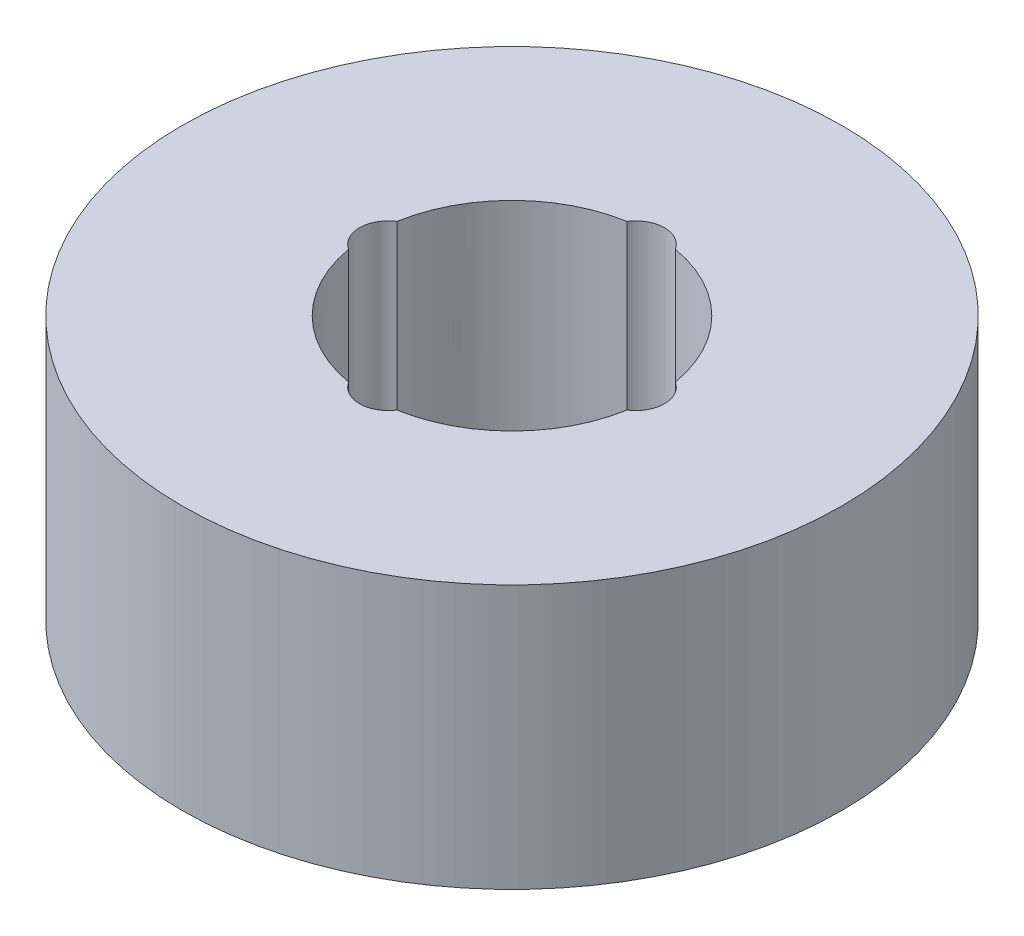
ISO-10303-21;
HEADER;
FILE_DESCRIPTION(('STEP AP214'),'2;1');
FILE_NAME('part.step','',(''),(''),'','','');
FILE_SCHEMA(('AUTOMOTIVE_DESIGN { 1 0 10303 214 1 1 1 1 }'));
ENDSEC;
DATA;
#1=APPLICATION_CONTEXT('core data for automotive mechanical design processes');
#2=APPLICATION_PROTOCOL_DEFINITION('international standard','automotive_design',2000,#1);
#3=PRODUCT_CONTEXT('',#1,'mechanical');
#4=PRODUCT('Part','Part','',(#3));
#5=PRODUCT_RELATED_PRODUCT_CATEGORY('part','',(#4));
#6=PRODUCT_DEFINITION_FORMATION('','',#4);
#7=PRODUCT_DEFINITION_CONTEXT('part definition',#1,'design');
#8=PRODUCT_DEFINITION('design','',#6,#7);
#9=PRODUCT_DEFINITION_SHAPE('','',#8);
#10=(LENGTH_UNIT() NAMED_UNIT(*) SI_UNIT(.MILLI.,.METRE.));
#11=(NAMED_UNIT(*) PLANE_ANGLE_UNIT() SI_UNIT($,.RADIAN.));
#12=(NAMED_UNIT(*) SI_UNIT($,.STERADIAN.) SOLID_ANGLE_UNIT());
#13=UNCERTAINTY_MEASURE_WITH_UNIT(LENGTH_MEASURE(1.E-05),#10,'distance_accuracy_value','');
#14=(GEOMETRIC_REPRESENTATION_CONTEXT(3) GLOBAL_UNCERTAINTY_ASSIGNED_CONTEXT((#13)) GLOBAL_UNIT_ASSIGNED_CONTEXT((#10,
#11,#12)) REPRESENTATION_CONTEXT('',''));
#15=CARTESIAN_POINT('',(0.,0.,0.));
#16=DIRECTION('',(0.,0.,1.));
#17=DIRECTION('',(1.,0.,0.));
#18=AXIS2_PLACEMENT_3D('',#15,#16,#17);
#19=CARTESIAN_POINT('',(0.,14.,0.));
#20=DIRECTION('',(0.,-1.,0.));
#21=DIRECTION('',(0.,0.,-1.));
#22=AXIS2_PLACEMENT_3D('',#19,#20,#21);
#23=CYLINDRICAL_SURFACE('',#22,17.5);
#24=CARTESIAN_POINT('',(0.,14.,0.));
#25=DIRECTION('',(0.,1.,0.));
#26=DIRECTION('',(0.,0.,1.));
#27=AXIS2_PLACEMENT_3D('',#24,#25,#26);
#28=CIRCLE('',#27,17.5);
#29=CARTESIAN_POINT('',(0.,14.,17.5));
#30=VERTEX_POINT('',#29);
#31=EDGE_CURVE('E148',#30,#30,#28,.T.);
#32=ORIENTED_EDGE('',*,*,#31,.F.);
#33=EDGE_LOOP('',(#32));
#34=FACE_BOUND('',#33,.T.);
#35=CARTESIAN_POINT('',(0.,0.,0.));
#36=DIRECTION('',(0.,1.,0.));
#37=DIRECTION('',(0.,0.,1.));
#38=AXIS2_PLACEMENT_3D('',#35,#36,#37);
#39=CIRCLE('',#38,17.5);
#40=CARTESIAN_POINT('',(0.,0.,17.5));
#41=VERTEX_POINT('',#40);
#42=EDGE_CURVE('E139',#41,#41,#39,.T.);
#43=ORIENTED_EDGE('',*,*,#42,.T.);
#44=EDGE_LOOP('',(#43));
#45=FACE_BOUND('',#44,.T.);
#46=ADVANCED_FACE('F39',(#34,#45),#23,.T.);
#47=CARTESIAN_POINT('',(0.,14.,0.));
#48=DIRECTION('',(0.,1.,0.));
#49=DIRECTION('',(0.,0.,1.));
#50=AXIS2_PLACEMENT_3D('',#47,#48,#49);
#51=PLANE('',#50);
#52=CARTESIAN_POINT('',(0.,14.,6.56736885858729));
#53=DIRECTION('',(0.,1.,0.));
#54=DIRECTION('',(1.,0.,0.));
#55=AXIS2_PLACEMENT_3D('',#52,#53,#54);
#56=CIRCLE('',#55,1.52423775104503);
#57=CARTESIAN_POINT('',(-1.28361419085378,14.,7.38933925388724));
#58=VERTEX_POINT('',#57);
#59=CARTESIAN_POINT('',(1.28361419085383,14.,7.38933925388723));
#60=VERTEX_POINT('',#59);
#61=EDGE_CURVE('E175',#58,#60,#56,.T.);
#62=ORIENTED_EDGE('',*,*,#61,.F.);
#63=CARTESIAN_POINT('',(0.,14.,0.));
#64=DIRECTION('',(0.,1.,0.));
#65=DIRECTION('',(0.,0.,1.));
#66=AXIS2_PLACEMENT_3D('',#63,#64,#65);
#67=CIRCLE('',#66,7.5);
#68=CARTESIAN_POINT('',(-7.38933925388723,14.,1.2836141908538));
#69=VERTEX_POINT('',#68);
#70=EDGE_CURVE('E134',#69,#58,#67,.T.);
#71=ORIENTED_EDGE('',*,*,#70,.F.);
#72=CARTESIAN_POINT('',(-6.56736885858729,14.,0.));
#73=DIRECTION('',(0.,1.,0.));
#74=DIRECTION('',(0.,0.,1.));
#75=AXIS2_PLACEMENT_3D('',#72,#73,#74);
#76=CIRCLE('',#75,1.52423775104503);
#77=CARTESIAN_POINT('',(-7.38933925388723,14.,-1.2836141908538));
#78=VERTEX_POINT('',#77);
#79=EDGE_CURVE('E143',#78,#69,#76,.T.);
#80=ORIENTED_EDGE('',*,*,#79,.F.);
#81=CARTESIAN_POINT('',(-1.28361419085388,14.,-7.38933925388722));
#82=VERTEX_POINT('',#81);
#83=EDGE_CURVE('E123',#82,#78,#67,.T.);
#84=ORIENTED_EDGE('',*,*,#83,.F.);
#85=CARTESIAN_POINT('',(0.,14.,-6.56736885858729));
#86=DIRECTION('',(0.,1.,0.));
#87=DIRECTION('',(-1.,0.,0.));
#88=AXIS2_PLACEMENT_3D('',#85,#86,#87);
#89=CIRCLE('',#88,1.52423775104503);
#90=CARTESIAN_POINT('',(1.28361419085373,14.,-7.38933925388725));
#91=VERTEX_POINT('',#90);
#92=EDGE_CURVE('E106',#91,#82,#89,.T.);
#93=ORIENTED_EDGE('',*,*,#92,.F.);
#94=CARTESIAN_POINT('',(7.38933925388723,14.,-1.2836141908538));
#95=VERTEX_POINT('',#94);
#96=EDGE_CURVE('E125',#95,#91,#67,.T.);
#97=ORIENTED_EDGE('',*,*,#96,.F.);
#98=CARTESIAN_POINT('',(6.56736885858729,14.,0.));
#99=DIRECTION('',(0.,1.,0.));
#100=DIRECTION('',(0.,0.,-1.));
#101=AXIS2_PLACEMENT_3D('',#98,#99,#100);
#102=CIRCLE('',#101,1.52423775104503);
#103=CARTESIAN_POINT('',(7.38933925388723,14.,1.2836141908538));
#104=VERTEX_POINT('',#103);
#105=EDGE_CURVE('E286',#104,#95,#102,.T.);
#106=ORIENTED_EDGE('',*,*,#105,.F.);
#107=EDGE_CURVE('E135',#60,#104,#67,.T.);
#108=ORIENTED_EDGE('',*,*,#107,.F.);
#109=EDGE_LOOP('',(#62,#71,#80,#84,#93,#97,#106,#108));
#110=FACE_BOUND('',#109,.T.);
#111=ORIENTED_EDGE('',*,*,#31,.T.);
#112=EDGE_LOOP('',(#111));
#113=FACE_BOUND('',#112,.T.);
#114=ADVANCED_FACE('F118',(#110,#113),#51,.T.);
#115=CARTESIAN_POINT('',(0.,0.,0.));
#116=DIRECTION('',(0.,1.,0.));
#117=DIRECTION('',(0.,0.,1.));
#118=AXIS2_PLACEMENT_3D('',#115,#116,#117);
#119=PLANE('',#118);
#120=CARTESIAN_POINT('',(0.,0.,0.));
#121=DIRECTION('',(0.,1.,0.));
#122=DIRECTION('',(0.,0.,1.));
#123=AXIS2_PLACEMENT_3D('',#120,#121,#122);
#124=CIRCLE('',#123,7.5);
#125=CARTESIAN_POINT('',(0.,0.,7.5));
#126=VERTEX_POINT('',#125);
#127=EDGE_CURVE('E136',#126,#126,#124,.T.);
#128=ORIENTED_EDGE('',*,*,#127,.T.);
#129=EDGE_LOOP('',(#128));
#130=FACE_BOUND('',#129,.T.);
#131=ORIENTED_EDGE('',*,*,#42,.F.);
#132=EDGE_LOOP('',(#131));
#133=FACE_BOUND('',#132,.T.);
#134=ADVANCED_FACE('F187',(#130,#133),#119,.F.);
#135=CARTESIAN_POINT('',(0.,14.,0.));
#136=DIRECTION('',(0.,-1.,0.));
#137=DIRECTION('',(0.,0.,-1.));
#138=AXIS2_PLACEMENT_3D('',#135,#136,#137);
#139=CYLINDRICAL_SURFACE('',#138,7.5);
#140=DIRECTION('',(0.,1.,0.));
#141=VECTOR('',#140,1.);
#142=CARTESIAN_POINT('',(-1.28361419085378,9.5207751766926,7.38933925388724));
#143=LINE('',#142,#141);
#144=CARTESIAN_POINT('',(-1.28361419085378,5.04155035338519,7.38933925388724));
#145=VERTEX_POINT('',#144);
#146=EDGE_CURVE('E11',#145,#58,#143,.T.);
#147=ORIENTED_EDGE('',*,*,#146,.F.);
#148=CARTESIAN_POINT('',(0.,5.04155035338519,0.));
#149=DIRECTION('',(0.,1.,0.));
#150=DIRECTION('',(0.,0.,1.));
#151=AXIS2_PLACEMENT_3D('',#148,#149,#150);
#152=CIRCLE('',#151,7.5);
#153=CARTESIAN_POINT('',(1.28361419085383,5.04155035338519,7.38933925388723));
#154=VERTEX_POINT('',#153);
#155=EDGE_CURVE('E170',#145,#154,#152,.T.);
#156=ORIENTED_EDGE('',*,*,#155,.T.);
#157=DIRECTION('',(0.,1.,0.));
#158=VECTOR('',#157,1.);
#159=CARTESIAN_POINT('',(1.28361419085383,9.5207751766926,7.38933925388723));
#160=LINE('',#159,#158);
#161=EDGE_CURVE('E46',#60,#154,#160,.F.);
#162=ORIENTED_EDGE('',*,*,#161,.F.);
#163=ORIENTED_EDGE('',*,*,#107,.T.);
#164=DIRECTION('',(0.,1.,0.));
#165=VECTOR('',#164,1.);
#166=CARTESIAN_POINT('',(7.38933925388723,9.5207751766926,1.2836141908538));
#167=LINE('',#166,#165);
#168=CARTESIAN_POINT('',(7.38933925388723,5.04155035338519,1.2836141908538));
#169=VERTEX_POINT('',#168);
#170=EDGE_CURVE('E164',#169,#104,#167,.T.);
#171=ORIENTED_EDGE('',*,*,#170,.F.);
#172=CARTESIAN_POINT('',(0.,5.04155035338519,0.));
#173=DIRECTION('',(0.,1.,0.));
#174=DIRECTION('',(0.,0.,1.));
#175=AXIS2_PLACEMENT_3D('',#172,#173,#174);
#176=CIRCLE('',#175,7.5);
#177=CARTESIAN_POINT('',(7.38933925388723,5.04155035338519,-1.2836141908538));
#178=VERTEX_POINT('',#177);
#179=EDGE_CURVE('E115',#169,#178,#176,.T.);
#180=ORIENTED_EDGE('',*,*,#179,.T.);
#181=DIRECTION('',(0.,1.,0.));
#182=VECTOR('',#181,1.);
#183=CARTESIAN_POINT('',(7.38933925388723,9.5207751766926,-1.2836141908538));
#184=LINE('',#183,#182);
#185=EDGE_CURVE('E131',#95,#178,#184,.F.);
#186=ORIENTED_EDGE('',*,*,#185,.F.);
#187=ORIENTED_EDGE('',*,*,#96,.T.);
#188=DIRECTION('',(0.,1.,0.));
#189=VECTOR('',#188,1.);
#190=CARTESIAN_POINT('',(1.28361419085373,9.5207751766926,-7.38933925388725));
#191=LINE('',#190,#189);
#192=CARTESIAN_POINT('',(1.28361419085373,5.04155035338519,-7.38933925388725));
#193=VERTEX_POINT('',#192);
#194=EDGE_CURVE('E105',#193,#91,#191,.T.);
#195=ORIENTED_EDGE('',*,*,#194,.F.);
#196=CARTESIAN_POINT('',(0.,5.04155035338519,0.));
#197=DIRECTION('',(0.,1.,0.));
#198=DIRECTION('',(0.,0.,1.));
#199=AXIS2_PLACEMENT_3D('',#196,#197,#198);
#200=CIRCLE('',#199,7.5);
#201=CARTESIAN_POINT('',(-1.28361419085388,5.04155035338519,-7.38933925388722));
#202=VERTEX_POINT('',#201);
#203=EDGE_CURVE('E159',#193,#202,#200,.T.);
#204=ORIENTED_EDGE('',*,*,#203,.T.);
#205=DIRECTION('',(0.,1.,0.));
#206=VECTOR('',#205,1.);
#207=CARTESIAN_POINT('',(-1.28361419085388,9.5207751766926,-7.38933925388722));
#208=LINE('',#207,#206);
#209=EDGE_CURVE('E114',#82,#202,#208,.F.);
#210=ORIENTED_EDGE('',*,*,#209,.F.);
#211=ORIENTED_EDGE('',*,*,#83,.T.);
#212=DIRECTION('',(0.,1.,0.));
#213=VECTOR('',#212,1.);
#214=CARTESIAN_POINT('',(-7.38933925388723,9.5207751766926,-1.2836141908538));
#215=LINE('',#214,#213);
#216=CARTESIAN_POINT('',(-7.38933925388723,5.04155035338519,-1.2836141908538));
#217=VERTEX_POINT('',#216);
#218=EDGE_CURVE('E160',#217,#78,#215,.T.);
#219=ORIENTED_EDGE('',*,*,#218,.F.);
#220=CARTESIAN_POINT('',(0.,5.04155035338519,0.));
#221=DIRECTION('',(0.,1.,0.));
#222=DIRECTION('',(0.,0.,1.));
#223=AXIS2_PLACEMENT_3D('',#220,#221,#222);
#224=CIRCLE('',#223,7.5);
#225=CARTESIAN_POINT('',(-7.38933925388723,5.04155035338519,1.2836141908538));
#226=VERTEX_POINT('',#225);
#227=EDGE_CURVE('E149',#217,#226,#224,.T.);
#228=ORIENTED_EDGE('',*,*,#227,.T.);
#229=DIRECTION('',(0.,1.,0.));
#230=VECTOR('',#229,1.);
#231=CARTESIAN_POINT('',(-7.38933925388723,9.5207751766926,1.2836141908538));
#232=LINE('',#231,#230);
#233=EDGE_CURVE('E152',#69,#226,#232,.F.);
#234=ORIENTED_EDGE('',*,*,#233,.F.);
#235=ORIENTED_EDGE('',*,*,#70,.T.);
#236=EDGE_LOOP('',(#147,#156,#162,#163,#171,#180,#186,#187,#195,#204,#210,#211,#219,#228,#234,#235));
#237=FACE_BOUND('',#236,.T.);
#238=ORIENTED_EDGE('',*,*,#127,.F.);
#239=EDGE_LOOP('',(#238));
#240=FACE_BOUND('',#239,.T.);
#241=ADVANCED_FACE('F126',(#237,#240),#139,.F.);
#242=CARTESIAN_POINT('',(-6.56736885858729,5.04155035338519,0.));
#243=DIRECTION('',(0.,1.,0.));
#244=DIRECTION('',(0.,0.,1.));
#245=AXIS2_PLACEMENT_3D('',#242,#243,#244);
#246=CYLINDRICAL_SURFACE('',#245,1.52423775104503);
#247=ORIENTED_EDGE('',*,*,#218,.T.);
#248=ORIENTED_EDGE('',*,*,#79,.T.);
#249=ORIENTED_EDGE('',*,*,#233,.T.);
#250=CARTESIAN_POINT('',(-6.56736885858729,5.04155035338519,0.));
#251=DIRECTION('',(0.,1.,0.));
#252=DIRECTION('',(0.,0.,1.));
#253=AXIS2_PLACEMENT_3D('',#250,#251,#252);
#254=CIRCLE('',#253,1.52423775104503);
#255=EDGE_CURVE('E144',#217,#226,#254,.T.);
#256=ORIENTED_EDGE('',*,*,#255,.F.);
#257=EDGE_LOOP('',(#247,#248,#249,#256));
#258=FACE_BOUND('',#257,.T.);
#259=ADVANCED_FACE('F200',(#258),#246,.F.);
#260=CARTESIAN_POINT('',(-6.56736885858729,5.04155035338519,0.));
#261=DIRECTION('',(0.,1.,0.));
#262=DIRECTION('',(0.,0.,1.));
#263=AXIS2_PLACEMENT_3D('',#260,#261,#262);
#264=PLANE('',#263);
#265=ORIENTED_EDGE('',*,*,#255,.T.);
#266=ORIENTED_EDGE('',*,*,#227,.F.);
#267=EDGE_LOOP('',(#265,#266));
#268=FACE_BOUND('',#267,.T.);
#269=ADVANCED_FACE('F201',(#268),#264,.T.);
#270=CARTESIAN_POINT('',(0.,5.04155035338519,-6.56736885858729));
#271=DIRECTION('',(0.,1.,0.));
#272=DIRECTION('',(0.,0.,1.));
#273=AXIS2_PLACEMENT_3D('',#270,#271,#272);
#274=CYLINDRICAL_SURFACE('',#273,1.52423775104503);
#275=ORIENTED_EDGE('',*,*,#194,.T.);
#276=ORIENTED_EDGE('',*,*,#92,.T.);
#277=ORIENTED_EDGE('',*,*,#209,.T.);
#278=CARTESIAN_POINT('',(0.,5.04155035338519,-6.56736885858729));
#279=DIRECTION('',(0.,1.,0.));
#280=DIRECTION('',(-1.,0.,0.));
#281=AXIS2_PLACEMENT_3D('',#278,#279,#280);
#282=CIRCLE('',#281,1.52423775104503);
#283=EDGE_CURVE('E107',#193,#202,#282,.T.);
#284=ORIENTED_EDGE('',*,*,#283,.F.);
#285=EDGE_LOOP('',(#275,#276,#277,#284));
#286=FACE_BOUND('',#285,.T.);
#287=ADVANCED_FACE('F102',(#286),#274,.F.);
#288=CARTESIAN_POINT('',(0.,5.04155035338519,-6.56736885858729));
#289=DIRECTION('',(0.,1.,0.));
#290=DIRECTION('',(-1.,0.,0.));
#291=AXIS2_PLACEMENT_3D('',#288,#289,#290);
#292=PLANE('',#291);
#293=ORIENTED_EDGE('',*,*,#283,.T.);
#294=ORIENTED_EDGE('',*,*,#203,.F.);
#295=EDGE_LOOP('',(#293,#294));
#296=FACE_BOUND('',#295,.T.);
#297=ADVANCED_FACE('F209',(#296),#292,.T.);
#298=CARTESIAN_POINT('',(6.56736885858729,5.04155035338519,0.));
#299=DIRECTION('',(0.,1.,0.));
#300=DIRECTION('',(0.,0.,1.));
#301=AXIS2_PLACEMENT_3D('',#298,#299,#300);
#302=CYLINDRICAL_SURFACE('',#301,1.52423775104503);
#303=ORIENTED_EDGE('',*,*,#170,.T.);
#304=ORIENTED_EDGE('',*,*,#105,.T.);
#305=ORIENTED_EDGE('',*,*,#185,.T.);
#306=CARTESIAN_POINT('',(6.56736885858729,5.04155035338519,0.));
#307=DIRECTION('',(0.,1.,0.));
#308=DIRECTION('',(0.,0.,-1.));
#309=AXIS2_PLACEMENT_3D('',#306,#307,#308);
#310=CIRCLE('',#309,1.52423775104503);
#311=EDGE_CURVE('E56',#169,#178,#310,.T.);
#312=ORIENTED_EDGE('',*,*,#311,.F.);
#313=EDGE_LOOP('',(#303,#304,#305,#312));
#314=FACE_BOUND('',#313,.T.);
#315=ADVANCED_FACE('F213',(#314),#302,.F.);
#316=CARTESIAN_POINT('',(6.56736885858729,5.04155035338519,0.));
#317=DIRECTION('',(0.,1.,0.));
#318=DIRECTION('',(0.,0.,-1.));
#319=AXIS2_PLACEMENT_3D('',#316,#317,#318);
#320=PLANE('',#319);
#321=ORIENTED_EDGE('',*,*,#311,.T.);
#322=ORIENTED_EDGE('',*,*,#179,.F.);
#323=EDGE_LOOP('',(#321,#322));
#324=FACE_BOUND('',#323,.T.);
#325=ADVANCED_FACE('F179',(#324),#320,.T.);
#326=CARTESIAN_POINT('',(0.,5.04155035338519,6.56736885858729));
#327=DIRECTION('',(0.,1.,0.));
#328=DIRECTION('',(0.,0.,1.));
#329=AXIS2_PLACEMENT_3D('',#326,#327,#328);
#330=CYLINDRICAL_SURFACE('',#329,1.52423775104503);
#331=ORIENTED_EDGE('',*,*,#146,.T.);
#332=ORIENTED_EDGE('',*,*,#61,.T.);
#333=ORIENTED_EDGE('',*,*,#161,.T.);
#334=CARTESIAN_POINT('',(0.,5.04155035338519,6.56736885858729));
#335=DIRECTION('',(0.,1.,0.));
#336=DIRECTION('',(1.,0.,0.));
#337=AXIS2_PLACEMENT_3D('',#334,#335,#336);
#338=CIRCLE('',#337,1.52423775104503);
#339=EDGE_CURVE('E55',#145,#154,#338,.T.);
#340=ORIENTED_EDGE('',*,*,#339,.F.);
#341=EDGE_LOOP('',(#331,#332,#333,#340));
#342=FACE_BOUND('',#341,.T.);
#343=ADVANCED_FACE('F171',(#342),#330,.F.);
#344=CARTESIAN_POINT('',(0.,5.04155035338519,6.56736885858729));
#345=DIRECTION('',(0.,1.,0.));
#346=DIRECTION('',(1.,0.,0.));
#347=AXIS2_PLACEMENT_3D('',#344,#345,#346);
#348=PLANE('',#347);
#349=ORIENTED_EDGE('',*,*,#339,.T.);
#350=ORIENTED_EDGE('',*,*,#155,.F.);
#351=EDGE_LOOP('',(#349,#350));
#352=FACE_BOUND('',#351,.T.);
#353=ADVANCED_FACE('F173',(#352),#348,.T.);
#354=CLOSED_SHELL('',(#46,#114,#134,#241,#259,#269,#287,#297,#315,#325,#343,#353));
#355=MANIFOLD_SOLID_BREP('B2',#354);
#356=ADVANCED_BREP_SHAPE_REPRESENTATION('',(#18,#355),#14);
#357=SHAPE_DEFINITION_REPRESENTATION(#9,#356);
ENDSEC;
END-ISO-10303-21;
